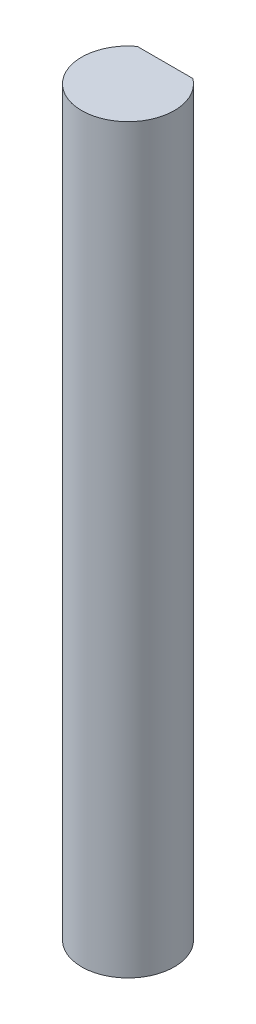
ISO-10303-21;
HEADER;
FILE_DESCRIPTION(('STEP AP214'),'2;1');
FILE_NAME('part.step','',(''),(''),'','','');
FILE_SCHEMA(('AUTOMOTIVE_DESIGN { 1 0 10303 214 1 1 1 1 }'));
ENDSEC;
DATA;
#1=APPLICATION_CONTEXT('core data for automotive mechanical design processes');
#2=APPLICATION_PROTOCOL_DEFINITION('international standard','automotive_design',2000,#1);
#3=PRODUCT_CONTEXT('',#1,'mechanical');
#4=PRODUCT('Part','Part','',(#3));
#5=PRODUCT_RELATED_PRODUCT_CATEGORY('part','',(#4));
#6=PRODUCT_DEFINITION_FORMATION('','',#4);
#7=PRODUCT_DEFINITION_CONTEXT('part definition',#1,'design');
#8=PRODUCT_DEFINITION('design','',#6,#7);
#9=PRODUCT_DEFINITION_SHAPE('','',#8);
#10=(LENGTH_UNIT() NAMED_UNIT(*) SI_UNIT(.MILLI.,.METRE.));
#11=(NAMED_UNIT(*) PLANE_ANGLE_UNIT() SI_UNIT($,.RADIAN.));
#12=(NAMED_UNIT(*) SI_UNIT($,.STERADIAN.) SOLID_ANGLE_UNIT());
#13=UNCERTAINTY_MEASURE_WITH_UNIT(LENGTH_MEASURE(1.E-05),#10,'distance_accuracy_value','');
#14=(GEOMETRIC_REPRESENTATION_CONTEXT(3) GLOBAL_UNCERTAINTY_ASSIGNED_CONTEXT((#13)) GLOBAL_UNIT_ASSIGNED_CONTEXT((#10,
#11,#12)) REPRESENTATION_CONTEXT('',''));
#15=CARTESIAN_POINT('',(0.,0.,0.));
#16=DIRECTION('',(0.,0.,1.));
#17=DIRECTION('',(1.,0.,0.));
#18=AXIS2_PLACEMENT_3D('',#15,#16,#17);
#19=CARTESIAN_POINT('',(0.,50.8,0.));
#20=DIRECTION('',(0.,-1.,0.));
#21=DIRECTION('',(0.,0.,-1.));
#22=AXIS2_PLACEMENT_3D('',#19,#20,#21);
#23=CYLINDRICAL_SURFACE('',#22,3.175);
#24=CARTESIAN_POINT('',(0.,0.,0.));
#25=DIRECTION('',(0.,1.,0.));
#26=DIRECTION('',(0.,0.,1.));
#27=AXIS2_PLACEMENT_3D('',#24,#25,#26);
#28=CIRCLE('',#27,3.175);
#29=CARTESIAN_POINT('',(-1.905,0.,-2.54));
#30=VERTEX_POINT('',#29);
#31=CARTESIAN_POINT('',(1.905,0.,-2.54));
#32=VERTEX_POINT('',#31);
#33=EDGE_CURVE('E64',#30,#32,#28,.T.);
#34=ORIENTED_EDGE('',*,*,#33,.T.);
#35=DIRECTION('',(0.,-1.,0.));
#36=VECTOR('',#35,1.);
#37=CARTESIAN_POINT('',(1.905,50.8,-2.54));
#38=LINE('',#37,#36);
#39=CARTESIAN_POINT('',(1.905,50.8,-2.54));
#40=VERTEX_POINT('',#39);
#41=EDGE_CURVE('E11',#40,#32,#38,.T.);
#42=ORIENTED_EDGE('',*,*,#41,.F.);
#43=CARTESIAN_POINT('',(0.,50.8,0.));
#44=DIRECTION('',(0.,1.,0.));
#45=DIRECTION('',(0.,0.,1.));
#46=AXIS2_PLACEMENT_3D('',#43,#44,#45);
#47=CIRCLE('',#46,3.175);
#48=CARTESIAN_POINT('',(-1.905,50.8,-2.54));
#49=VERTEX_POINT('',#48);
#50=EDGE_CURVE('E63',#49,#40,#47,.T.);
#51=ORIENTED_EDGE('',*,*,#50,.F.);
#52=DIRECTION('',(0.,-1.,0.));
#53=VECTOR('',#52,1.);
#54=CARTESIAN_POINT('',(-1.905,50.8,-2.54));
#55=LINE('',#54,#53);
#56=EDGE_CURVE('E41',#49,#30,#55,.T.);
#57=ORIENTED_EDGE('',*,*,#56,.T.);
#58=EDGE_LOOP('',(#34,#42,#51,#57));
#59=FACE_BOUND('',#58,.T.);
#60=ADVANCED_FACE('F33',(#59),#23,.T.);
#61=CARTESIAN_POINT('',(-1.905,50.8,-2.54));
#62=DIRECTION('',(0.,0.,1.));
#63=DIRECTION('',(1.,0.,0.));
#64=AXIS2_PLACEMENT_3D('',#61,#62,#63);
#65=PLANE('',#64);
#66=DIRECTION('',(-1.,0.,0.));
#67=VECTOR('',#66,1.);
#68=CARTESIAN_POINT('',(-1.905,0.,-2.54));
#69=LINE('',#68,#67);
#70=EDGE_CURVE('E56',#32,#30,#69,.T.);
#71=ORIENTED_EDGE('',*,*,#70,.T.);
#72=ORIENTED_EDGE('',*,*,#56,.F.);
#73=DIRECTION('',(-1.,0.,0.));
#74=VECTOR('',#73,1.);
#75=CARTESIAN_POINT('',(-1.905,50.8,-2.54));
#76=LINE('',#75,#74);
#77=EDGE_CURVE('E48',#40,#49,#76,.T.);
#78=ORIENTED_EDGE('',*,*,#77,.F.);
#79=ORIENTED_EDGE('',*,*,#41,.T.);
#80=EDGE_LOOP('',(#71,#72,#78,#79));
#81=FACE_BOUND('',#80,.T.);
#82=ADVANCED_FACE('F59',(#81),#65,.F.);
#83=CARTESIAN_POINT('',(0.,50.8,0.));
#84=DIRECTION('',(0.,1.,0.));
#85=DIRECTION('',(0.,0.,1.));
#86=AXIS2_PLACEMENT_3D('',#83,#84,#85);
#87=PLANE('',#86);
#88=ORIENTED_EDGE('',*,*,#50,.T.);
#89=ORIENTED_EDGE('',*,*,#77,.T.);
#90=EDGE_LOOP('',(#88,#89));
#91=FACE_BOUND('',#90,.T.);
#92=ADVANCED_FACE('F71',(#91),#87,.T.);
#93=CARTESIAN_POINT('',(0.,0.,0.));
#94=DIRECTION('',(0.,1.,0.));
#95=DIRECTION('',(0.,0.,1.));
#96=AXIS2_PLACEMENT_3D('',#93,#94,#95);
#97=PLANE('',#96);
#98=ORIENTED_EDGE('',*,*,#33,.F.);
#99=ORIENTED_EDGE('',*,*,#70,.F.);
#100=EDGE_LOOP('',(#98,#99));
#101=FACE_BOUND('',#100,.T.);
#102=ADVANCED_FACE('F67',(#101),#97,.F.);
#103=CLOSED_SHELL('',(#60,#82,#92,#102));
#104=MANIFOLD_SOLID_BREP('B2',#103);
#105=ADVANCED_BREP_SHAPE_REPRESENTATION('',(#18,#104),#14);
#106=SHAPE_DEFINITION_REPRESENTATION(#9,#105);
ENDSEC;
END-ISO-10303-21;
